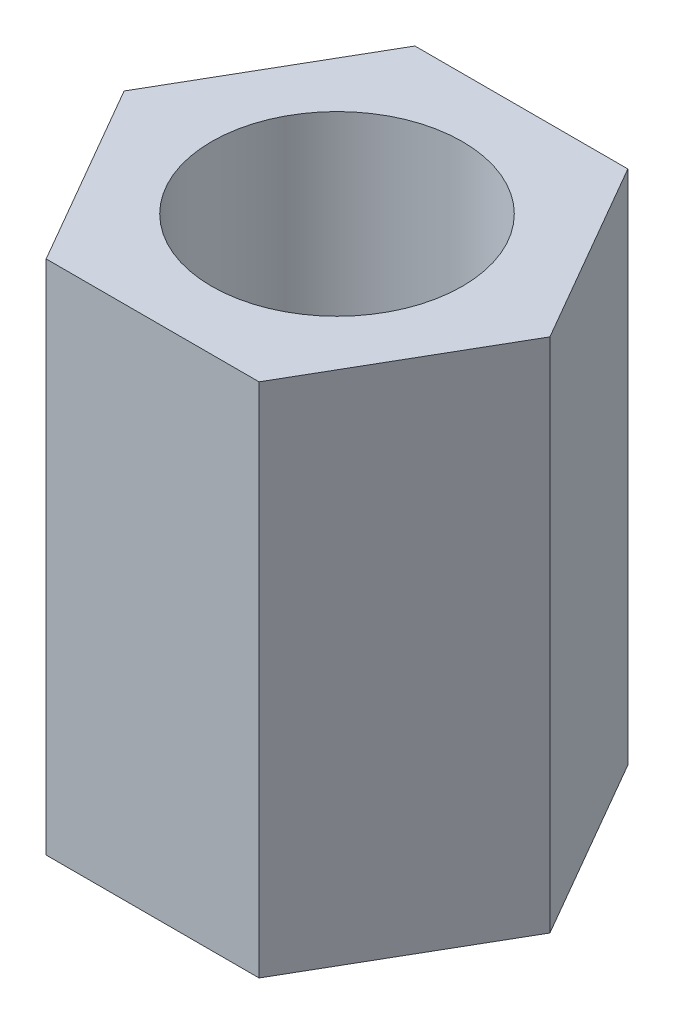
ISO-10303-21;
HEADER;
FILE_DESCRIPTION(('STEP AP214'),'2;1');
FILE_NAME('part.step','',(''),(''),'','','');
FILE_SCHEMA(('AUTOMOTIVE_DESIGN { 1 0 10303 214 1 1 1 1 }'));
ENDSEC;
DATA;
#1=APPLICATION_CONTEXT('core data for automotive mechanical design processes');
#2=APPLICATION_PROTOCOL_DEFINITION('international standard','automotive_design',2000,#1);
#3=PRODUCT_CONTEXT('',#1,'mechanical');
#4=PRODUCT('Part','Part','',(#3));
#5=PRODUCT_RELATED_PRODUCT_CATEGORY('part','',(#4));
#6=PRODUCT_DEFINITION_FORMATION('','',#4);
#7=PRODUCT_DEFINITION_CONTEXT('part definition',#1,'design');
#8=PRODUCT_DEFINITION('design','',#6,#7);
#9=PRODUCT_DEFINITION_SHAPE('','',#8);
#10=(LENGTH_UNIT() NAMED_UNIT(*) SI_UNIT(.MILLI.,.METRE.));
#11=(NAMED_UNIT(*) PLANE_ANGLE_UNIT() SI_UNIT($,.RADIAN.));
#12=(NAMED_UNIT(*) SI_UNIT($,.STERADIAN.) SOLID_ANGLE_UNIT());
#13=UNCERTAINTY_MEASURE_WITH_UNIT(LENGTH_MEASURE(1.E-05),#10,'distance_accuracy_value','');
#14=(GEOMETRIC_REPRESENTATION_CONTEXT(3) GLOBAL_UNCERTAINTY_ASSIGNED_CONTEXT((#13)) GLOBAL_UNIT_ASSIGNED_CONTEXT((#10,
#11,#12)) REPRESENTATION_CONTEXT('',''));
#15=CARTESIAN_POINT('',(0.,0.,0.));
#16=DIRECTION('',(0.,0.,1.));
#17=DIRECTION('',(1.,0.,0.));
#18=AXIS2_PLACEMENT_3D('',#15,#16,#17);
#19=CARTESIAN_POINT('',(0.,3.5,0.));
#20=DIRECTION('',(0.,1.,0.));
#21=DIRECTION('',(0.,0.,1.));
#22=AXIS2_PLACEMENT_3D('',#19,#20,#21);
#23=PLANE('',#22);
#24=DIRECTION('',(-0.5,0.,0.866025403784439));
#25=VECTOR('',#24,1.);
#26=CARTESIAN_POINT('',(-1.44337567297406,3.5,-2.5));
#27=LINE('',#26,#25);
#28=CARTESIAN_POINT('',(-1.44337567297406,3.5,-2.5));
#29=VERTEX_POINT('',#28);
#30=CARTESIAN_POINT('',(-2.88675134594813,3.5,0.));
#31=VERTEX_POINT('',#30);
#32=EDGE_CURVE('E129',#29,#31,#27,.T.);
#33=ORIENTED_EDGE('',*,*,#32,.T.);
#34=DIRECTION('',(0.5,0.,0.866025403784439));
#35=VECTOR('',#34,1.);
#36=CARTESIAN_POINT('',(-2.88675134594813,3.5,0.));
#37=LINE('',#36,#35);
#38=CARTESIAN_POINT('',(-1.44337567297406,3.5,2.5));
#39=VERTEX_POINT('',#38);
#40=EDGE_CURVE('E87',#31,#39,#37,.T.);
#41=ORIENTED_EDGE('',*,*,#40,.T.);
#42=DIRECTION('',(1.,0.,0.));
#43=VECTOR('',#42,1.);
#44=CARTESIAN_POINT('',(-1.44337567297406,3.5,2.5));
#45=LINE('',#44,#43);
#46=CARTESIAN_POINT('',(1.44337567297406,3.5,2.5));
#47=VERTEX_POINT('',#46);
#48=EDGE_CURVE('E100',#39,#47,#45,.T.);
#49=ORIENTED_EDGE('',*,*,#48,.T.);
#50=DIRECTION('',(0.5,0.,-0.866025403784439));
#51=VECTOR('',#50,1.);
#52=CARTESIAN_POINT('',(1.44337567297406,3.5,2.5));
#53=LINE('',#52,#51);
#54=CARTESIAN_POINT('',(2.88675134594813,3.5,0.));
#55=VERTEX_POINT('',#54);
#56=EDGE_CURVE('E94',#47,#55,#53,.T.);
#57=ORIENTED_EDGE('',*,*,#56,.T.);
#58=DIRECTION('',(-0.5,0.,-0.866025403784439));
#59=VECTOR('',#58,1.);
#60=CARTESIAN_POINT('',(2.88675134594813,3.5,0.));
#61=LINE('',#60,#59);
#62=CARTESIAN_POINT('',(1.44337567297407,3.5,-2.5));
#63=VERTEX_POINT('',#62);
#64=EDGE_CURVE('E98',#55,#63,#61,.T.);
#65=ORIENTED_EDGE('',*,*,#64,.T.);
#66=DIRECTION('',(-1.,0.,0.));
#67=VECTOR('',#66,1.);
#68=CARTESIAN_POINT('',(1.44337567297407,3.5,-2.5));
#69=LINE('',#68,#67);
#70=EDGE_CURVE('E50',#63,#29,#69,.T.);
#71=ORIENTED_EDGE('',*,*,#70,.T.);
#72=EDGE_LOOP('',(#33,#41,#49,#57,#65,#71));
#73=FACE_BOUND('',#72,.T.);
#74=CARTESIAN_POINT('',(0.,3.5,0.));
#75=DIRECTION('',(0.,1.,0.));
#76=DIRECTION('',(0.,0.,1.));
#77=AXIS2_PLACEMENT_3D('',#74,#75,#76);
#78=CIRCLE('',#77,1.7);
#79=CARTESIAN_POINT('',(0.,3.5,1.7));
#80=VERTEX_POINT('',#79);
#81=EDGE_CURVE('E122',#80,#80,#78,.T.);
#82=ORIENTED_EDGE('',*,*,#81,.F.);
#83=EDGE_LOOP('',(#82));
#84=FACE_BOUND('',#83,.T.);
#85=ADVANCED_FACE('F33',(#73,#84),#23,.T.);
#86=CARTESIAN_POINT('',(0.,-3.5,0.));
#87=DIRECTION('',(0.,1.,0.));
#88=DIRECTION('',(0.,0.,1.));
#89=AXIS2_PLACEMENT_3D('',#86,#87,#88);
#90=PLANE('',#89);
#91=DIRECTION('',(-0.5,0.,0.866025403784439));
#92=VECTOR('',#91,1.);
#93=CARTESIAN_POINT('',(-1.44337567297406,-3.5,-2.5));
#94=LINE('',#93,#92);
#95=CARTESIAN_POINT('',(-1.44337567297406,-3.5,-2.5));
#96=VERTEX_POINT('',#95);
#97=CARTESIAN_POINT('',(-2.88675134594813,-3.5,0.));
#98=VERTEX_POINT('',#97);
#99=EDGE_CURVE('E118',#96,#98,#94,.T.);
#100=ORIENTED_EDGE('',*,*,#99,.F.);
#101=DIRECTION('',(-1.,0.,0.));
#102=VECTOR('',#101,1.);
#103=CARTESIAN_POINT('',(1.44337567297407,-3.5,-2.5));
#104=LINE('',#103,#102);
#105=CARTESIAN_POINT('',(1.44337567297407,-3.5,-2.5));
#106=VERTEX_POINT('',#105);
#107=EDGE_CURVE('E79',#106,#96,#104,.T.);
#108=ORIENTED_EDGE('',*,*,#107,.F.);
#109=DIRECTION('',(-0.5,0.,-0.866025403784439));
#110=VECTOR('',#109,1.);
#111=CARTESIAN_POINT('',(2.88675134594813,-3.5,0.));
#112=LINE('',#111,#110);
#113=CARTESIAN_POINT('',(2.88675134594813,-3.5,0.));
#114=VERTEX_POINT('',#113);
#115=EDGE_CURVE('E73',#114,#106,#112,.T.);
#116=ORIENTED_EDGE('',*,*,#115,.F.);
#117=DIRECTION('',(0.5,0.,-0.866025403784439));
#118=VECTOR('',#117,1.);
#119=CARTESIAN_POINT('',(1.44337567297406,-3.5,2.5));
#120=LINE('',#119,#118);
#121=CARTESIAN_POINT('',(1.44337567297406,-3.5,2.5));
#122=VERTEX_POINT('',#121);
#123=EDGE_CURVE('E108',#122,#114,#120,.T.);
#124=ORIENTED_EDGE('',*,*,#123,.F.);
#125=DIRECTION('',(1.,0.,0.));
#126=VECTOR('',#125,1.);
#127=CARTESIAN_POINT('',(-1.44337567297406,-3.5,2.5));
#128=LINE('',#127,#126);
#129=CARTESIAN_POINT('',(-1.44337567297406,-3.5,2.5));
#130=VERTEX_POINT('',#129);
#131=EDGE_CURVE('E124',#130,#122,#128,.T.);
#132=ORIENTED_EDGE('',*,*,#131,.F.);
#133=DIRECTION('',(0.5,0.,0.866025403784439));
#134=VECTOR('',#133,1.);
#135=CARTESIAN_POINT('',(-2.88675134594813,-3.5,0.));
#136=LINE('',#135,#134);
#137=EDGE_CURVE('E121',#98,#130,#136,.T.);
#138=ORIENTED_EDGE('',*,*,#137,.F.);
#139=EDGE_LOOP('',(#100,#108,#116,#124,#132,#138));
#140=FACE_BOUND('',#139,.T.);
#141=CARTESIAN_POINT('',(0.,-3.5,0.));
#142=DIRECTION('',(0.,1.,0.));
#143=DIRECTION('',(0.,0.,1.));
#144=AXIS2_PLACEMENT_3D('',#141,#142,#143);
#145=CIRCLE('',#144,1.7);
#146=CARTESIAN_POINT('',(0.,-3.5,1.7));
#147=VERTEX_POINT('',#146);
#148=EDGE_CURVE('E222',#147,#147,#145,.T.);
#149=ORIENTED_EDGE('',*,*,#148,.T.);
#150=EDGE_LOOP('',(#149));
#151=FACE_BOUND('',#150,.T.);
#152=ADVANCED_FACE('F138',(#140,#151),#90,.F.);
#153=CARTESIAN_POINT('',(-1.44337567297406,3.5,-2.5));
#154=DIRECTION('',(0.866025403784438,0.,0.5));
#155=DIRECTION('',(0.5,0.,-0.866025403784439));
#156=AXIS2_PLACEMENT_3D('',#153,#154,#155);
#157=PLANE('',#156);
#158=ORIENTED_EDGE('',*,*,#99,.T.);
#159=DIRECTION('',(0.,-1.,0.));
#160=VECTOR('',#159,1.);
#161=CARTESIAN_POINT('',(-2.88675134594813,3.5,0.));
#162=LINE('',#161,#160);
#163=EDGE_CURVE('E11',#31,#98,#162,.T.);
#164=ORIENTED_EDGE('',*,*,#163,.F.);
#165=ORIENTED_EDGE('',*,*,#32,.F.);
#166=DIRECTION('',(0.,-1.,0.));
#167=VECTOR('',#166,1.);
#168=CARTESIAN_POINT('',(-1.44337567297406,3.5,-2.5));
#169=LINE('',#168,#167);
#170=EDGE_CURVE('E114',#29,#96,#169,.T.);
#171=ORIENTED_EDGE('',*,*,#170,.T.);
#172=EDGE_LOOP('',(#158,#164,#165,#171));
#173=FACE_BOUND('',#172,.T.);
#174=ADVANCED_FACE('F35',(#173),#157,.F.);
#175=CARTESIAN_POINT('',(-2.88675134594813,3.5,0.));
#176=DIRECTION('',(0.866025403784439,0.,-0.5));
#177=DIRECTION('',(-0.5,0.,-0.866025403784439));
#178=AXIS2_PLACEMENT_3D('',#175,#176,#177);
#179=PLANE('',#178);
#180=ORIENTED_EDGE('',*,*,#137,.T.);
#181=DIRECTION('',(0.,-1.,0.));
#182=VECTOR('',#181,1.);
#183=CARTESIAN_POINT('',(-1.44337567297406,3.5,2.5));
#184=LINE('',#183,#182);
#185=EDGE_CURVE('E42',#39,#130,#184,.T.);
#186=ORIENTED_EDGE('',*,*,#185,.F.);
#187=ORIENTED_EDGE('',*,*,#40,.F.);
#188=ORIENTED_EDGE('',*,*,#163,.T.);
#189=EDGE_LOOP('',(#180,#186,#187,#188));
#190=FACE_BOUND('',#189,.T.);
#191=ADVANCED_FACE('F163',(#190),#179,.F.);
#192=CARTESIAN_POINT('',(-1.44337567297406,3.5,2.5));
#193=DIRECTION('',(0.,0.,-1.));
#194=DIRECTION('',(-1.,0.,0.));
#195=AXIS2_PLACEMENT_3D('',#192,#193,#194);
#196=PLANE('',#195);
#197=ORIENTED_EDGE('',*,*,#131,.T.);
#198=DIRECTION('',(0.,-1.,0.));
#199=VECTOR('',#198,1.);
#200=CARTESIAN_POINT('',(1.44337567297406,3.5,2.5));
#201=LINE('',#200,#199);
#202=EDGE_CURVE('E109',#47,#122,#201,.T.);
#203=ORIENTED_EDGE('',*,*,#202,.F.);
#204=ORIENTED_EDGE('',*,*,#48,.F.);
#205=ORIENTED_EDGE('',*,*,#185,.T.);
#206=EDGE_LOOP('',(#197,#203,#204,#205));
#207=FACE_BOUND('',#206,.T.);
#208=ADVANCED_FACE('F135',(#207),#196,.F.);
#209=CARTESIAN_POINT('',(1.44337567297406,3.5,2.5));
#210=DIRECTION('',(-0.866025403784439,0.,-0.5));
#211=DIRECTION('',(-0.5,0.,0.866025403784439));
#212=AXIS2_PLACEMENT_3D('',#209,#210,#211);
#213=PLANE('',#212);
#214=ORIENTED_EDGE('',*,*,#123,.T.);
#215=DIRECTION('',(0.,-1.,0.));
#216=VECTOR('',#215,1.);
#217=CARTESIAN_POINT('',(2.88675134594813,3.5,0.));
#218=LINE('',#217,#216);
#219=EDGE_CURVE('E105',#55,#114,#218,.T.);
#220=ORIENTED_EDGE('',*,*,#219,.F.);
#221=ORIENTED_EDGE('',*,*,#56,.F.);
#222=ORIENTED_EDGE('',*,*,#202,.T.);
#223=EDGE_LOOP('',(#214,#220,#221,#222));
#224=FACE_BOUND('',#223,.T.);
#225=ADVANCED_FACE('F106',(#224),#213,.F.);
#226=CARTESIAN_POINT('',(2.88675134594813,3.5,0.));
#227=DIRECTION('',(-0.866025403784439,0.,0.5));
#228=DIRECTION('',(0.5,0.,0.866025403784439));
#229=AXIS2_PLACEMENT_3D('',#226,#227,#228);
#230=PLANE('',#229);
#231=ORIENTED_EDGE('',*,*,#115,.T.);
#232=DIRECTION('',(0.,-1.,0.));
#233=VECTOR('',#232,1.);
#234=CARTESIAN_POINT('',(1.44337567297407,3.5,-2.5));
#235=LINE('',#234,#233);
#236=EDGE_CURVE('E110',#63,#106,#235,.T.);
#237=ORIENTED_EDGE('',*,*,#236,.F.);
#238=ORIENTED_EDGE('',*,*,#64,.F.);
#239=ORIENTED_EDGE('',*,*,#219,.T.);
#240=EDGE_LOOP('',(#231,#237,#238,#239));
#241=FACE_BOUND('',#240,.T.);
#242=ADVANCED_FACE('F112',(#241),#230,.F.);
#243=CARTESIAN_POINT('',(1.44337567297407,3.5,-2.5));
#244=DIRECTION('',(0.,0.,1.));
#245=DIRECTION('',(1.,0.,0.));
#246=AXIS2_PLACEMENT_3D('',#243,#244,#245);
#247=PLANE('',#246);
#248=ORIENTED_EDGE('',*,*,#107,.T.);
#249=ORIENTED_EDGE('',*,*,#170,.F.);
#250=ORIENTED_EDGE('',*,*,#70,.F.);
#251=ORIENTED_EDGE('',*,*,#236,.T.);
#252=EDGE_LOOP('',(#248,#249,#250,#251));
#253=FACE_BOUND('',#252,.T.);
#254=ADVANCED_FACE('F143',(#253),#247,.F.);
#255=CARTESIAN_POINT('',(0.,3.5,0.));
#256=DIRECTION('',(0.,-1.,0.));
#257=DIRECTION('',(0.,0.,-1.));
#258=AXIS2_PLACEMENT_3D('',#255,#256,#257);
#259=CYLINDRICAL_SURFACE('',#258,1.7);
#260=ORIENTED_EDGE('',*,*,#81,.T.);
#261=EDGE_LOOP('',(#260));
#262=FACE_BOUND('',#261,.T.);
#263=ORIENTED_EDGE('',*,*,#148,.F.);
#264=EDGE_LOOP('',(#263));
#265=FACE_BOUND('',#264,.T.);
#266=ADVANCED_FACE('F145',(#262,#265),#259,.F.);
#267=CLOSED_SHELL('',(#85,#152,#174,#191,#208,#225,#242,#254,#266));
#268=MANIFOLD_SOLID_BREP('B2',#267);
#269=ADVANCED_BREP_SHAPE_REPRESENTATION('',(#18,#268),#14);
#270=SHAPE_DEFINITION_REPRESENTATION(#9,#269);
ENDSEC;
END-ISO-10303-21;
